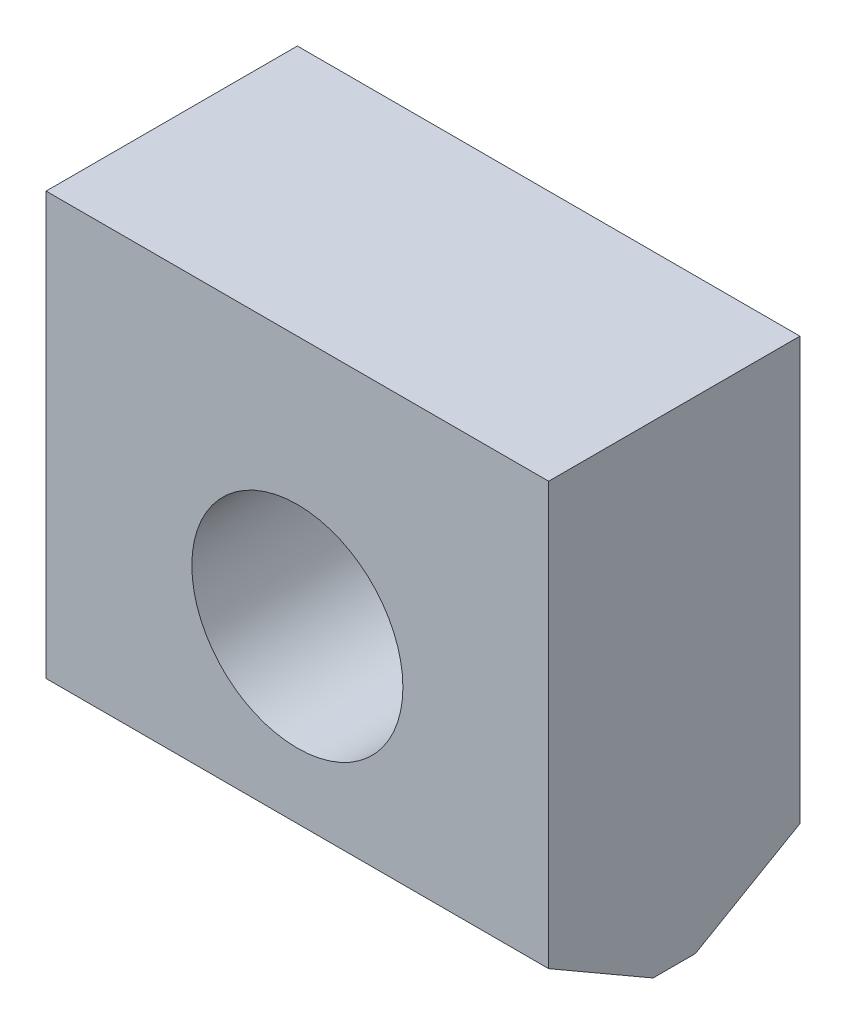
ISO-10303-21;
HEADER;
FILE_DESCRIPTION(('STEP AP214'),'2;1');
FILE_NAME('part.step','',(''),(''),'','','');
FILE_SCHEMA(('AUTOMOTIVE_DESIGN { 1 0 10303 214 1 1 1 1 }'));
ENDSEC;
DATA;
#1=APPLICATION_CONTEXT('core data for automotive mechanical design processes');
#2=APPLICATION_PROTOCOL_DEFINITION('international standard','automotive_design',2000,#1);
#3=PRODUCT_CONTEXT('',#1,'mechanical');
#4=PRODUCT('Part','Part','',(#3));
#5=PRODUCT_RELATED_PRODUCT_CATEGORY('part','',(#4));
#6=PRODUCT_DEFINITION_FORMATION('','',#4);
#7=PRODUCT_DEFINITION_CONTEXT('part definition',#1,'design');
#8=PRODUCT_DEFINITION('design','',#6,#7);
#9=PRODUCT_DEFINITION_SHAPE('','',#8);
#10=(LENGTH_UNIT() NAMED_UNIT(*) SI_UNIT(.MILLI.,.METRE.));
#11=(NAMED_UNIT(*) PLANE_ANGLE_UNIT() SI_UNIT($,.RADIAN.));
#12=(NAMED_UNIT(*) SI_UNIT($,.STERADIAN.) SOLID_ANGLE_UNIT());
#13=UNCERTAINTY_MEASURE_WITH_UNIT(LENGTH_MEASURE(1.E-05),#10,'distance_accuracy_value','');
#14=(GEOMETRIC_REPRESENTATION_CONTEXT(3) GLOBAL_UNCERTAINTY_ASSIGNED_CONTEXT((#13)) GLOBAL_UNIT_ASSIGNED_CONTEXT((#10,
#11,#12)) REPRESENTATION_CONTEXT('',''));
#15=CARTESIAN_POINT('',(0.,0.,0.));
#16=DIRECTION('',(0.,0.,1.));
#17=DIRECTION('',(1.,0.,0.));
#18=AXIS2_PLACEMENT_3D('',#15,#16,#17);
#19=CARTESIAN_POINT('',(0.,0.,25.));
#20=DIRECTION('',(1.,0.,0.));
#21=DIRECTION('',(0.,1.,0.));
#22=AXIS2_PLACEMENT_3D('',#19,#20,#21);
#23=PLANE('',#22);
#24=DIRECTION('',(0.,0.,-1.));
#25=VECTOR('',#24,1.);
#26=CARTESIAN_POINT('',(0.,0.,25.));
#27=LINE('',#26,#25);
#28=CARTESIAN_POINT('',(0.,0.,14.6076951545867));
#29=VERTEX_POINT('',#28);
#30=CARTESIAN_POINT('',(0.,0.,10.3923048454133));
#31=VERTEX_POINT('',#30);
#32=EDGE_CURVE('E120',#29,#31,#27,.T.);
#33=ORIENTED_EDGE('',*,*,#32,.F.);
#34=DIRECTION('',(0.,-0.500000000000001,-0.866025403784438));
#35=VECTOR('',#34,1.);
#36=CARTESIAN_POINT('',(0.,6.00000000000001,25.));
#37=LINE('',#36,#35);
#38=CARTESIAN_POINT('',(0.,6.00000000000001,25.));
#39=VERTEX_POINT('',#38);
#40=EDGE_CURVE('E11',#29,#39,#37,.F.);
#41=ORIENTED_EDGE('',*,*,#40,.T.);
#42=DIRECTION('',(0.,-1.,0.));
#43=VECTOR('',#42,1.);
#44=CARTESIAN_POINT('',(0.,0.,25.));
#45=LINE('',#44,#43);
#46=CARTESIAN_POINT('',(0.,48.,25.));
#47=VERTEX_POINT('',#46);
#48=EDGE_CURVE('E93',#47,#39,#45,.T.);
#49=ORIENTED_EDGE('',*,*,#48,.F.);
#50=DIRECTION('',(0.,0.,-1.));
#51=VECTOR('',#50,1.);
#52=CARTESIAN_POINT('',(0.,48.,25.));
#53=LINE('',#52,#51);
#54=CARTESIAN_POINT('',(0.,48.,0.));
#55=VERTEX_POINT('',#54);
#56=EDGE_CURVE('E103',#47,#55,#53,.T.);
#57=ORIENTED_EDGE('',*,*,#56,.T.);
#58=DIRECTION('',(0.,-1.,0.));
#59=VECTOR('',#58,1.);
#60=CARTESIAN_POINT('',(0.,0.,0.));
#61=LINE('',#60,#59);
#62=CARTESIAN_POINT('',(0.,6.00000000000001,0.));
#63=VERTEX_POINT('',#62);
#64=EDGE_CURVE('E112',#55,#63,#61,.T.);
#65=ORIENTED_EDGE('',*,*,#64,.T.);
#66=DIRECTION('',(0.,-0.500000000000001,0.866025403784438));
#67=VECTOR('',#66,1.);
#68=CARTESIAN_POINT('',(0.,0.,10.3923048454133));
#69=LINE('',#68,#67);
#70=EDGE_CURVE('E129',#63,#31,#69,.T.);
#71=ORIENTED_EDGE('',*,*,#70,.T.);
#72=EDGE_LOOP('',(#33,#41,#49,#57,#65,#71));
#73=FACE_BOUND('',#72,.T.);
#74=ADVANCED_FACE('F34',(#73),#23,.F.);
#75=CARTESIAN_POINT('',(0.,0.,25.));
#76=DIRECTION('',(0.,1.,0.));
#77=DIRECTION('',(-1.,0.,0.));
#78=AXIS2_PLACEMENT_3D('',#75,#76,#77);
#79=PLANE('',#78);
#80=DIRECTION('',(0.,0.,-1.));
#81=VECTOR('',#80,1.);
#82=CARTESIAN_POINT('',(50.0000000000001,0.,25.));
#83=LINE('',#82,#81);
#84=CARTESIAN_POINT('',(50.0000000000001,0.,14.6076951545867));
#85=VERTEX_POINT('',#84);
#86=CARTESIAN_POINT('',(50.0000000000001,0.,10.3923048454133));
#87=VERTEX_POINT('',#86);
#88=EDGE_CURVE('E102',#85,#87,#83,.T.);
#89=ORIENTED_EDGE('',*,*,#88,.F.);
#90=DIRECTION('',(-1.,0.,0.));
#91=VECTOR('',#90,1.);
#92=CARTESIAN_POINT('',(0.,0.,14.6076951545867));
#93=LINE('',#92,#91);
#94=EDGE_CURVE('E42',#85,#29,#93,.T.);
#95=ORIENTED_EDGE('',*,*,#94,.T.);
#96=ORIENTED_EDGE('',*,*,#32,.T.);
#97=DIRECTION('',(1.,0.,0.));
#98=VECTOR('',#97,1.);
#99=CARTESIAN_POINT('',(50.0000000000001,0.,10.3923048454133));
#100=LINE('',#99,#98);
#101=EDGE_CURVE('E122',#31,#87,#100,.T.);
#102=ORIENTED_EDGE('',*,*,#101,.T.);
#103=EDGE_LOOP('',(#89,#95,#96,#102));
#104=FACE_BOUND('',#103,.T.);
#105=ADVANCED_FACE('F142',(#104),#79,.F.);
#106=CARTESIAN_POINT('',(50.0000000000001,0.,25.));
#107=DIRECTION('',(-1.,0.,0.));
#108=DIRECTION('',(0.,-1.,0.));
#109=AXIS2_PLACEMENT_3D('',#106,#107,#108);
#110=PLANE('',#109);
#111=DIRECTION('',(0.,1.,0.));
#112=VECTOR('',#111,1.);
#113=CARTESIAN_POINT('',(50.0000000000001,0.,25.));
#114=LINE('',#113,#112);
#115=CARTESIAN_POINT('',(50.0000000000001,6.00000000000002,25.));
#116=VERTEX_POINT('',#115);
#117=CARTESIAN_POINT('',(50.,48.,25.));
#118=VERTEX_POINT('',#117);
#119=EDGE_CURVE('E84',#116,#118,#114,.T.);
#120=ORIENTED_EDGE('',*,*,#119,.F.);
#121=DIRECTION('',(0.,0.500000000000001,0.866025403784438));
#122=VECTOR('',#121,1.);
#123=CARTESIAN_POINT('',(50.0000000000001,6.00000000000004,25.));
#124=LINE('',#123,#122);
#125=EDGE_CURVE('E56',#116,#85,#124,.F.);
#126=ORIENTED_EDGE('',*,*,#125,.T.);
#127=ORIENTED_EDGE('',*,*,#88,.T.);
#128=DIRECTION('',(0.,0.500000000000001,-0.866025403784438));
#129=VECTOR('',#128,1.);
#130=CARTESIAN_POINT('',(50.0000000000001,0.,10.3923048454132));
#131=LINE('',#130,#129);
#132=CARTESIAN_POINT('',(50.0000000000001,6.00000000000002,0.));
#133=VERTEX_POINT('',#132);
#134=EDGE_CURVE('E125',#87,#133,#131,.T.);
#135=ORIENTED_EDGE('',*,*,#134,.T.);
#136=DIRECTION('',(0.,1.,0.));
#137=VECTOR('',#136,1.);
#138=CARTESIAN_POINT('',(50.0000000000001,0.,0.));
#139=LINE('',#138,#137);
#140=CARTESIAN_POINT('',(50.,48.,0.));
#141=VERTEX_POINT('',#140);
#142=EDGE_CURVE('E99',#133,#141,#139,.T.);
#143=ORIENTED_EDGE('',*,*,#142,.T.);
#144=DIRECTION('',(0.,0.,-1.));
#145=VECTOR('',#144,1.);
#146=CARTESIAN_POINT('',(50.,48.,25.));
#147=LINE('',#146,#145);
#148=EDGE_CURVE('E96',#118,#141,#147,.T.);
#149=ORIENTED_EDGE('',*,*,#148,.F.);
#150=EDGE_LOOP('',(#120,#126,#127,#135,#143,#149));
#151=FACE_BOUND('',#150,.T.);
#152=ADVANCED_FACE('F97',(#151),#110,.F.);
#153=CARTESIAN_POINT('',(0.,48.,25.));
#154=DIRECTION('',(0.,-1.,0.));
#155=DIRECTION('',(0.,0.,-1.));
#156=AXIS2_PLACEMENT_3D('',#153,#154,#155);
#157=PLANE('',#156);
#158=DIRECTION('',(-1.,0.,0.));
#159=VECTOR('',#158,1.);
#160=CARTESIAN_POINT('',(0.,48.,0.));
#161=LINE('',#160,#159);
#162=EDGE_CURVE('E117',#141,#55,#161,.T.);
#163=ORIENTED_EDGE('',*,*,#162,.T.);
#164=ORIENTED_EDGE('',*,*,#56,.F.);
#165=DIRECTION('',(-1.,0.,0.));
#166=VECTOR('',#165,1.);
#167=CARTESIAN_POINT('',(0.,48.,25.));
#168=LINE('',#167,#166);
#169=EDGE_CURVE('E89',#118,#47,#168,.T.);
#170=ORIENTED_EDGE('',*,*,#169,.F.);
#171=ORIENTED_EDGE('',*,*,#148,.T.);
#172=EDGE_LOOP('',(#163,#164,#170,#171));
#173=FACE_BOUND('',#172,.T.);
#174=ADVANCED_FACE('F105',(#173),#157,.F.);
#175=CARTESIAN_POINT('',(0.,0.,25.));
#176=DIRECTION('',(0.,0.,-1.));
#177=DIRECTION('',(-1.,0.,0.));
#178=AXIS2_PLACEMENT_3D('',#175,#176,#177);
#179=PLANE('',#178);
#180=CARTESIAN_POINT('',(25.0000000000001,23.,25.));
#181=DIRECTION('',(0.,0.,1.));
#182=DIRECTION('',(1.,0.,0.));
#183=AXIS2_PLACEMENT_3D('',#180,#181,#182);
#184=CIRCLE('',#183,10.5);
#185=CARTESIAN_POINT('',(35.5000000000001,23.,25.));
#186=VERTEX_POINT('',#185);
#187=EDGE_CURVE('E145',#186,#186,#184,.T.);
#188=ORIENTED_EDGE('',*,*,#187,.F.);
#189=EDGE_LOOP('',(#188));
#190=FACE_BOUND('',#189,.T.);
#191=ORIENTED_EDGE('',*,*,#48,.T.);
#192=DIRECTION('',(1.,0.,0.));
#193=VECTOR('',#192,1.);
#194=CARTESIAN_POINT('',(0.,6.00000000000001,25.));
#195=LINE('',#194,#193);
#196=EDGE_CURVE('E92',#39,#116,#195,.T.);
#197=ORIENTED_EDGE('',*,*,#196,.T.);
#198=ORIENTED_EDGE('',*,*,#119,.T.);
#199=ORIENTED_EDGE('',*,*,#169,.T.);
#200=EDGE_LOOP('',(#191,#197,#198,#199));
#201=FACE_BOUND('',#200,.T.);
#202=ADVANCED_FACE('F87',(#190,#201),#179,.F.);
#203=CARTESIAN_POINT('',(0.,0.,0.));
#204=DIRECTION('',(0.,0.,-1.));
#205=DIRECTION('',(-1.,0.,0.));
#206=AXIS2_PLACEMENT_3D('',#203,#204,#205);
#207=PLANE('',#206);
#208=CARTESIAN_POINT('',(25.0000000000001,23.,0.));
#209=DIRECTION('',(0.,0.,1.));
#210=DIRECTION('',(1.,0.,0.));
#211=AXIS2_PLACEMENT_3D('',#208,#209,#210);
#212=CIRCLE('',#211,10.5);
#213=CARTESIAN_POINT('',(35.5000000000001,23.,0.));
#214=VERTEX_POINT('',#213);
#215=EDGE_CURVE('E115',#214,#214,#212,.T.);
#216=ORIENTED_EDGE('',*,*,#215,.T.);
#217=EDGE_LOOP('',(#216));
#218=FACE_BOUND('',#217,.T.);
#219=ORIENTED_EDGE('',*,*,#142,.F.);
#220=DIRECTION('',(-1.,0.,0.));
#221=VECTOR('',#220,1.);
#222=CARTESIAN_POINT('',(0.,6.00000000000001,0.));
#223=LINE('',#222,#221);
#224=EDGE_CURVE('E127',#133,#63,#223,.T.);
#225=ORIENTED_EDGE('',*,*,#224,.T.);
#226=ORIENTED_EDGE('',*,*,#64,.F.);
#227=ORIENTED_EDGE('',*,*,#162,.F.);
#228=EDGE_LOOP('',(#219,#225,#226,#227));
#229=FACE_BOUND('',#228,.T.);
#230=ADVANCED_FACE('F151',(#218,#229),#207,.T.);
#231=CARTESIAN_POINT('',(25.0000000000001,23.,0.));
#232=DIRECTION('',(0.,0.,1.));
#233=DIRECTION('',(1.,0.,0.));
#234=AXIS2_PLACEMENT_3D('',#231,#232,#233);
#235=CYLINDRICAL_SURFACE('',#234,10.5);
#236=ORIENTED_EDGE('',*,*,#215,.F.);
#237=EDGE_LOOP('',(#236));
#238=FACE_BOUND('',#237,.T.);
#239=ORIENTED_EDGE('',*,*,#187,.T.);
#240=EDGE_LOOP('',(#239));
#241=FACE_BOUND('',#240,.T.);
#242=ADVANCED_FACE('F154',(#238,#241),#235,.F.);
#243=CARTESIAN_POINT('',(0.,0.,10.3923048454133));
#244=DIRECTION('',(0.,-0.866025403784438,-0.500000000000001));
#245=DIRECTION('',(-1.,0.,0.));
#246=AXIS2_PLACEMENT_3D('',#243,#244,#245);
#247=PLANE('',#246);
#248=ORIENTED_EDGE('',*,*,#70,.F.);
#249=ORIENTED_EDGE('',*,*,#224,.F.);
#250=ORIENTED_EDGE('',*,*,#134,.F.);
#251=ORIENTED_EDGE('',*,*,#101,.F.);
#252=EDGE_LOOP('',(#248,#249,#250,#251));
#253=FACE_BOUND('',#252,.T.);
#254=ADVANCED_FACE('F141',(#253),#247,.T.);
#255=CARTESIAN_POINT('',(0.,6.00000000000001,25.));
#256=DIRECTION('',(0.,0.866025403784438,-0.500000000000001));
#257=DIRECTION('',(1.,0.,0.));
#258=AXIS2_PLACEMENT_3D('',#255,#256,#257);
#259=PLANE('',#258);
#260=ORIENTED_EDGE('',*,*,#40,.F.);
#261=ORIENTED_EDGE('',*,*,#94,.F.);
#262=ORIENTED_EDGE('',*,*,#125,.F.);
#263=ORIENTED_EDGE('',*,*,#196,.F.);
#264=EDGE_LOOP('',(#260,#261,#262,#263));
#265=FACE_BOUND('',#264,.T.);
#266=ADVANCED_FACE('F36',(#265),#259,.F.);
#267=CLOSED_SHELL('',(#74,#105,#152,#174,#202,#230,#242,#254,#266));
#268=MANIFOLD_SOLID_BREP('B2',#267);
#269=ADVANCED_BREP_SHAPE_REPRESENTATION('',(#18,#268),#14);
#270=SHAPE_DEFINITION_REPRESENTATION(#9,#269);
ENDSEC;
END-ISO-10303-21;
